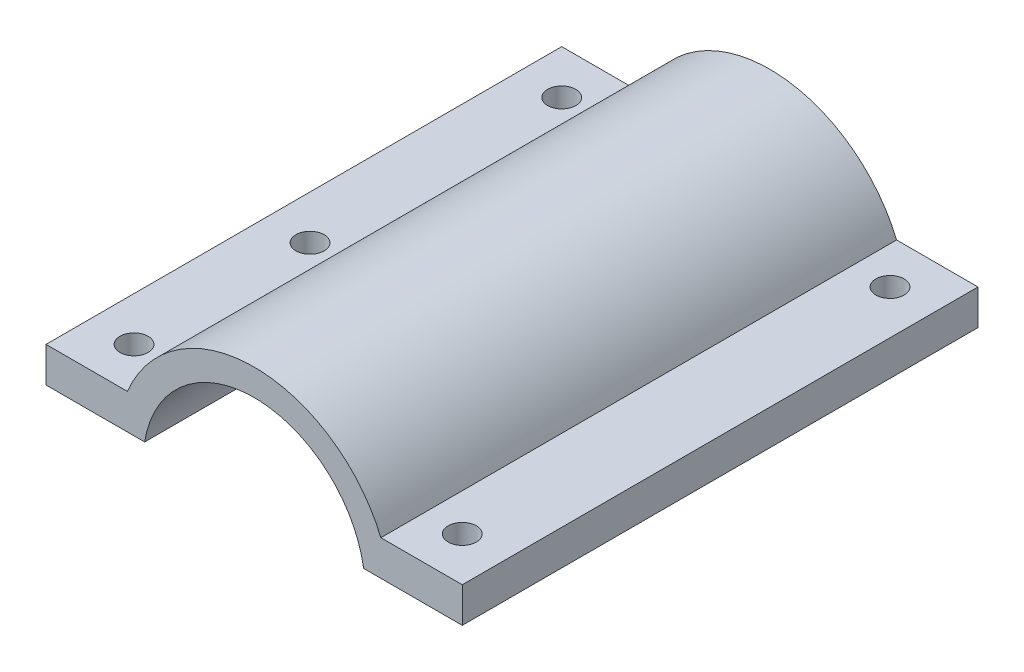
ISO-10303-21;
HEADER;
FILE_DESCRIPTION(('STEP AP214'),'2;1');
FILE_NAME('part.step','',(''),(''),'','','');
FILE_SCHEMA(('AUTOMOTIVE_DESIGN { 1 0 10303 214 1 1 1 1 }'));
ENDSEC;
DATA;
#1=APPLICATION_CONTEXT('core data for automotive mechanical design processes');
#2=APPLICATION_PROTOCOL_DEFINITION('international standard','automotive_design',2000,#1);
#3=PRODUCT_CONTEXT('',#1,'mechanical');
#4=PRODUCT('Part','Part','',(#3));
#5=PRODUCT_RELATED_PRODUCT_CATEGORY('part','',(#4));
#6=PRODUCT_DEFINITION_FORMATION('','',#4);
#7=PRODUCT_DEFINITION_CONTEXT('part definition',#1,'design');
#8=PRODUCT_DEFINITION('design','',#6,#7);
#9=PRODUCT_DEFINITION_SHAPE('','',#8);
#10=(LENGTH_UNIT() NAMED_UNIT(*) SI_UNIT(.MILLI.,.METRE.));
#11=(NAMED_UNIT(*) PLANE_ANGLE_UNIT() SI_UNIT($,.RADIAN.));
#12=(NAMED_UNIT(*) SI_UNIT($,.STERADIAN.) SOLID_ANGLE_UNIT());
#13=UNCERTAINTY_MEASURE_WITH_UNIT(LENGTH_MEASURE(1.E-05),#10,'distance_accuracy_value','');
#14=(GEOMETRIC_REPRESENTATION_CONTEXT(3) GLOBAL_UNCERTAINTY_ASSIGNED_CONTEXT((#13)) GLOBAL_UNIT_ASSIGNED_CONTEXT((#10,
#11,#12)) REPRESENTATION_CONTEXT('',''));
#15=CARTESIAN_POINT('',(0.,0.,0.));
#16=DIRECTION('',(0.,0.,1.));
#17=DIRECTION('',(1.,0.,0.));
#18=AXIS2_PLACEMENT_3D('',#15,#16,#17);
#19=CARTESIAN_POINT('',(-23.65,6.,58.6));
#20=DIRECTION('',(1.,0.,0.));
#21=DIRECTION('',(0.,0.,-1.));
#22=AXIS2_PLACEMENT_3D('',#19,#20,#21);
#23=PLANE('',#22);
#24=DIRECTION('',(0.,-1.,0.));
#25=VECTOR('',#24,1.);
#26=CARTESIAN_POINT('',(-23.65,6.,0.));
#27=LINE('',#26,#25);
#28=CARTESIAN_POINT('',(-23.65,6.,0.));
#29=VERTEX_POINT('',#28);
#30=CARTESIAN_POINT('',(-23.65,2.,0.));
#31=VERTEX_POINT('',#30);
#32=EDGE_CURVE('E129',#29,#31,#27,.T.);
#33=ORIENTED_EDGE('',*,*,#32,.T.);
#34=DIRECTION('',(0.,0.,-1.));
#35=VECTOR('',#34,1.);
#36=CARTESIAN_POINT('',(-23.65,2.,58.6));
#37=LINE('',#36,#35);
#38=CARTESIAN_POINT('',(-23.65,2.,58.6));
#39=VERTEX_POINT('',#38);
#40=EDGE_CURVE('E11',#39,#31,#37,.T.);
#41=ORIENTED_EDGE('',*,*,#40,.F.);
#42=DIRECTION('',(0.,-1.,0.));
#43=VECTOR('',#42,1.);
#44=CARTESIAN_POINT('',(-23.65,6.,58.6));
#45=LINE('',#44,#43);
#46=CARTESIAN_POINT('',(-23.65,6.,58.6));
#47=VERTEX_POINT('',#46);
#48=EDGE_CURVE('E144',#47,#39,#45,.T.);
#49=ORIENTED_EDGE('',*,*,#48,.F.);
#50=DIRECTION('',(0.,0.,-1.));
#51=VECTOR('',#50,1.);
#52=CARTESIAN_POINT('',(-23.65,6.,58.6));
#53=LINE('',#52,#51);
#54=EDGE_CURVE('E125',#47,#29,#53,.T.);
#55=ORIENTED_EDGE('',*,*,#54,.T.);
#56=EDGE_LOOP('',(#33,#41,#49,#55));
#57=FACE_BOUND('',#56,.T.);
#58=ADVANCED_FACE('F33',(#57),#23,.F.);
#59=CARTESIAN_POINT('',(-23.65,2.,58.6));
#60=DIRECTION('',(0.,1.,0.));
#61=DIRECTION('',(0.,0.,1.));
#62=AXIS2_PLACEMENT_3D('',#59,#60,#61);
#63=PLANE('',#62);
#64=CARTESIAN_POINT('',(-18.65,2.,33.6));
#65=DIRECTION('',(0.,1.,0.));
#66=DIRECTION('',(0.,0.,1.));
#67=AXIS2_PLACEMENT_3D('',#64,#65,#66);
#68=CIRCLE('',#67,1.6);
#69=CARTESIAN_POINT('',(-18.65,2.,35.2));
#70=VERTEX_POINT('',#69);
#71=EDGE_CURVE('E182',#70,#70,#68,.T.);
#72=ORIENTED_EDGE('',*,*,#71,.T.);
#73=EDGE_LOOP('',(#72));
#74=FACE_BOUND('',#73,.T.);
#75=CARTESIAN_POINT('',(-18.65,2.,5.));
#76=DIRECTION('',(0.,1.,0.));
#77=DIRECTION('',(0.,0.,1.));
#78=AXIS2_PLACEMENT_3D('',#75,#76,#77);
#79=CIRCLE('',#78,1.6);
#80=CARTESIAN_POINT('',(-18.65,2.,6.6));
#81=VERTEX_POINT('',#80);
#82=EDGE_CURVE('E185',#81,#81,#79,.T.);
#83=ORIENTED_EDGE('',*,*,#82,.T.);
#84=EDGE_LOOP('',(#83));
#85=FACE_BOUND('',#84,.T.);
#86=CARTESIAN_POINT('',(-18.65,2.,53.6));
#87=DIRECTION('',(0.,1.,0.));
#88=DIRECTION('',(0.,0.,1.));
#89=AXIS2_PLACEMENT_3D('',#86,#87,#88);
#90=CIRCLE('',#89,1.6);
#91=CARTESIAN_POINT('',(-18.65,2.,55.2));
#92=VERTEX_POINT('',#91);
#93=EDGE_CURVE('E188',#92,#92,#90,.T.);
#94=ORIENTED_EDGE('',*,*,#93,.T.);
#95=EDGE_LOOP('',(#94));
#96=FACE_BOUND('',#95,.T.);
#97=DIRECTION('',(1.,0.,0.));
#98=VECTOR('',#97,1.);
#99=CARTESIAN_POINT('',(-23.65,2.,0.));
#100=LINE('',#99,#98);
#101=CARTESIAN_POINT('',(-12.4402572320672,2.,0.));
#102=VERTEX_POINT('',#101);
#103=EDGE_CURVE('E132',#31,#102,#100,.T.);
#104=ORIENTED_EDGE('',*,*,#103,.T.);
#105=DIRECTION('',(0.,0.,-1.));
#106=VECTOR('',#105,1.);
#107=CARTESIAN_POINT('',(-12.4402572320672,2.,58.6));
#108=LINE('',#107,#106);
#109=CARTESIAN_POINT('',(-12.4402572320672,2.,58.6));
#110=VERTEX_POINT('',#109);
#111=EDGE_CURVE('E41',#110,#102,#108,.T.);
#112=ORIENTED_EDGE('',*,*,#111,.F.);
#113=DIRECTION('',(1.,0.,0.));
#114=VECTOR('',#113,1.);
#115=CARTESIAN_POINT('',(-23.65,2.,58.6));
#116=LINE('',#115,#114);
#117=EDGE_CURVE('E92',#39,#110,#116,.T.);
#118=ORIENTED_EDGE('',*,*,#117,.F.);
#119=ORIENTED_EDGE('',*,*,#40,.T.);
#120=EDGE_LOOP('',(#104,#112,#118,#119));
#121=FACE_BOUND('',#120,.T.);
#122=ADVANCED_FACE('F230',(#74,#85,#96,#121),#63,.F.);
#123=CARTESIAN_POINT('',(0.,0.,58.6));
#124=DIRECTION('',(0.,0.,-1.));
#125=DIRECTION('',(-1.,0.,0.));
#126=AXIS2_PLACEMENT_3D('',#123,#124,#125);
#127=CYLINDRICAL_SURFACE('',#126,12.6);
#128=CARTESIAN_POINT('',(0.,0.,0.));
#129=DIRECTION('',(0.,0.,-1.));
#130=DIRECTION('',(1.,0.,0.));
#131=AXIS2_PLACEMENT_3D('',#128,#129,#130);
#132=CIRCLE('',#131,12.6);
#133=CARTESIAN_POINT('',(12.4402572320672,2.,0.));
#134=VERTEX_POINT('',#133);
#135=EDGE_CURVE('E135',#102,#134,#132,.T.);
#136=ORIENTED_EDGE('',*,*,#135,.T.);
#137=DIRECTION('',(0.,0.,-1.));
#138=VECTOR('',#137,1.);
#139=CARTESIAN_POINT('',(12.4402572320672,2.,58.6));
#140=LINE('',#139,#138);
#141=CARTESIAN_POINT('',(12.4402572320672,2.,58.6));
#142=VERTEX_POINT('',#141);
#143=EDGE_CURVE('E151',#142,#134,#140,.T.);
#144=ORIENTED_EDGE('',*,*,#143,.F.);
#145=CARTESIAN_POINT('',(0.,0.,58.6));
#146=DIRECTION('',(0.,0.,-1.));
#147=DIRECTION('',(1.,0.,0.));
#148=AXIS2_PLACEMENT_3D('',#145,#146,#147);
#149=CIRCLE('',#148,12.6);
#150=EDGE_CURVE('E159',#110,#142,#149,.T.);
#151=ORIENTED_EDGE('',*,*,#150,.F.);
#152=ORIENTED_EDGE('',*,*,#111,.T.);
#153=EDGE_LOOP('',(#136,#144,#151,#152));
#154=FACE_BOUND('',#153,.T.);
#155=ADVANCED_FACE('F157',(#154),#127,.F.);
#156=CARTESIAN_POINT('',(23.65,2.,58.6));
#157=DIRECTION('',(0.,1.,0.));
#158=DIRECTION('',(0.,0.,1.));
#159=AXIS2_PLACEMENT_3D('',#156,#157,#158);
#160=PLANE('',#159);
#161=CARTESIAN_POINT('',(18.65,2.,53.6));
#162=DIRECTION('',(0.,1.,0.));
#163=DIRECTION('',(0.,0.,1.));
#164=AXIS2_PLACEMENT_3D('',#161,#162,#163);
#165=CIRCLE('',#164,1.6);
#166=CARTESIAN_POINT('',(18.65,2.,55.2));
#167=VERTEX_POINT('',#166);
#168=EDGE_CURVE('E133',#167,#167,#165,.T.);
#169=ORIENTED_EDGE('',*,*,#168,.T.);
#170=EDGE_LOOP('',(#169));
#171=FACE_BOUND('',#170,.T.);
#172=CARTESIAN_POINT('',(18.65,2.,5.));
#173=DIRECTION('',(0.,1.,0.));
#174=DIRECTION('',(0.,0.,1.));
#175=AXIS2_PLACEMENT_3D('',#172,#173,#174);
#176=CIRCLE('',#175,1.6);
#177=CARTESIAN_POINT('',(18.65,2.,6.6));
#178=VERTEX_POINT('',#177);
#179=EDGE_CURVE('E179',#178,#178,#176,.T.);
#180=ORIENTED_EDGE('',*,*,#179,.T.);
#181=EDGE_LOOP('',(#180));
#182=FACE_BOUND('',#181,.T.);
#183=DIRECTION('',(1.,0.,0.));
#184=VECTOR('',#183,1.);
#185=CARTESIAN_POINT('',(23.65,2.,0.));
#186=LINE('',#185,#184);
#187=CARTESIAN_POINT('',(23.65,2.,0.));
#188=VERTEX_POINT('',#187);
#189=EDGE_CURVE('E137',#134,#188,#186,.T.);
#190=ORIENTED_EDGE('',*,*,#189,.T.);
#191=DIRECTION('',(0.,0.,-1.));
#192=VECTOR('',#191,1.);
#193=CARTESIAN_POINT('',(23.65,2.,58.6));
#194=LINE('',#193,#192);
#195=CARTESIAN_POINT('',(23.65,2.,58.6));
#196=VERTEX_POINT('',#195);
#197=EDGE_CURVE('E148',#196,#188,#194,.T.);
#198=ORIENTED_EDGE('',*,*,#197,.F.);
#199=DIRECTION('',(1.,0.,0.));
#200=VECTOR('',#199,1.);
#201=CARTESIAN_POINT('',(23.65,2.,58.6));
#202=LINE('',#201,#200);
#203=EDGE_CURVE('E171',#142,#196,#202,.T.);
#204=ORIENTED_EDGE('',*,*,#203,.F.);
#205=ORIENTED_EDGE('',*,*,#143,.T.);
#206=EDGE_LOOP('',(#190,#198,#204,#205));
#207=FACE_BOUND('',#206,.T.);
#208=ADVANCED_FACE('F167',(#171,#182,#207),#160,.F.);
#209=CARTESIAN_POINT('',(23.65,6.,58.6));
#210=DIRECTION('',(-1.,0.,0.));
#211=DIRECTION('',(0.,0.,1.));
#212=AXIS2_PLACEMENT_3D('',#209,#210,#211);
#213=PLANE('',#212);
#214=DIRECTION('',(0.,1.,0.));
#215=VECTOR('',#214,1.);
#216=CARTESIAN_POINT('',(23.65,6.,0.));
#217=LINE('',#216,#215);
#218=CARTESIAN_POINT('',(23.65,6.,0.));
#219=VERTEX_POINT('',#218);
#220=EDGE_CURVE('E139',#188,#219,#217,.T.);
#221=ORIENTED_EDGE('',*,*,#220,.T.);
#222=DIRECTION('',(0.,0.,-1.));
#223=VECTOR('',#222,1.);
#224=CARTESIAN_POINT('',(23.65,6.,58.6));
#225=LINE('',#224,#223);
#226=CARTESIAN_POINT('',(23.65,6.,58.6));
#227=VERTEX_POINT('',#226);
#228=EDGE_CURVE('E120',#227,#219,#225,.T.);
#229=ORIENTED_EDGE('',*,*,#228,.F.);
#230=DIRECTION('',(0.,1.,0.));
#231=VECTOR('',#230,1.);
#232=CARTESIAN_POINT('',(23.65,6.,58.6));
#233=LINE('',#232,#231);
#234=EDGE_CURVE('E111',#196,#227,#233,.T.);
#235=ORIENTED_EDGE('',*,*,#234,.F.);
#236=ORIENTED_EDGE('',*,*,#197,.T.);
#237=EDGE_LOOP('',(#221,#229,#235,#236));
#238=FACE_BOUND('',#237,.T.);
#239=ADVANCED_FACE('F170',(#238),#213,.F.);
#240=CARTESIAN_POINT('',(14.4,6.,58.6));
#241=DIRECTION('',(0.,-1.,0.));
#242=DIRECTION('',(0.,0.,-1.));
#243=AXIS2_PLACEMENT_3D('',#240,#241,#242);
#244=PLANE('',#243);
#245=CARTESIAN_POINT('',(18.65,6.,53.6));
#246=DIRECTION('',(0.,1.,0.));
#247=DIRECTION('',(0.,0.,1.));
#248=AXIS2_PLACEMENT_3D('',#245,#246,#247);
#249=CIRCLE('',#248,1.6);
#250=CARTESIAN_POINT('',(18.65,6.,55.2));
#251=VERTEX_POINT('',#250);
#252=EDGE_CURVE('E194',#251,#251,#249,.T.);
#253=ORIENTED_EDGE('',*,*,#252,.F.);
#254=EDGE_LOOP('',(#253));
#255=FACE_BOUND('',#254,.T.);
#256=CARTESIAN_POINT('',(18.65,6.,5.));
#257=DIRECTION('',(0.,1.,0.));
#258=DIRECTION('',(0.,0.,1.));
#259=AXIS2_PLACEMENT_3D('',#256,#257,#258);
#260=CIRCLE('',#259,1.6);
#261=CARTESIAN_POINT('',(18.65,6.,6.6));
#262=VERTEX_POINT('',#261);
#263=EDGE_CURVE('E191',#262,#262,#260,.T.);
#264=ORIENTED_EDGE('',*,*,#263,.F.);
#265=EDGE_LOOP('',(#264));
#266=FACE_BOUND('',#265,.T.);
#267=DIRECTION('',(-1.,0.,0.));
#268=VECTOR('',#267,1.);
#269=CARTESIAN_POINT('',(14.4,6.,0.));
#270=LINE('',#269,#268);
#271=CARTESIAN_POINT('',(14.4,6.,0.));
#272=VERTEX_POINT('',#271);
#273=EDGE_CURVE('E119',#219,#272,#270,.T.);
#274=ORIENTED_EDGE('',*,*,#273,.T.);
#275=DIRECTION('',(0.,0.,-1.));
#276=VECTOR('',#275,1.);
#277=CARTESIAN_POINT('',(14.4,6.,58.6));
#278=LINE('',#277,#276);
#279=CARTESIAN_POINT('',(14.4,6.,58.6));
#280=VERTEX_POINT('',#279);
#281=EDGE_CURVE('E116',#280,#272,#278,.T.);
#282=ORIENTED_EDGE('',*,*,#281,.F.);
#283=DIRECTION('',(-1.,0.,0.));
#284=VECTOR('',#283,1.);
#285=CARTESIAN_POINT('',(14.4,6.,58.6));
#286=LINE('',#285,#284);
#287=EDGE_CURVE('E105',#227,#280,#286,.T.);
#288=ORIENTED_EDGE('',*,*,#287,.F.);
#289=ORIENTED_EDGE('',*,*,#228,.T.);
#290=EDGE_LOOP('',(#274,#282,#288,#289));
#291=FACE_BOUND('',#290,.T.);
#292=ADVANCED_FACE('F117',(#255,#266,#291),#244,.F.);
#293=CARTESIAN_POINT('',(0.,0.,58.6));
#294=DIRECTION('',(0.,0.,-1.));
#295=DIRECTION('',(-1.,0.,0.));
#296=AXIS2_PLACEMENT_3D('',#293,#294,#295);
#297=CYLINDRICAL_SURFACE('',#296,15.6);
#298=CARTESIAN_POINT('',(0.,0.,0.));
#299=DIRECTION('',(0.,0.,1.));
#300=DIRECTION('',(1.,0.,0.));
#301=AXIS2_PLACEMENT_3D('',#298,#299,#300);
#302=CIRCLE('',#301,15.6);
#303=CARTESIAN_POINT('',(-14.4,6.,0.));
#304=VERTEX_POINT('',#303);
#305=EDGE_CURVE('E78',#272,#304,#302,.T.);
#306=ORIENTED_EDGE('',*,*,#305,.T.);
#307=DIRECTION('',(0.,0.,-1.));
#308=VECTOR('',#307,1.);
#309=CARTESIAN_POINT('',(-14.4,6.,58.6));
#310=LINE('',#309,#308);
#311=CARTESIAN_POINT('',(-14.4,6.,58.6));
#312=VERTEX_POINT('',#311);
#313=EDGE_CURVE('E121',#312,#304,#310,.T.);
#314=ORIENTED_EDGE('',*,*,#313,.F.);
#315=CARTESIAN_POINT('',(0.,0.,58.6));
#316=DIRECTION('',(0.,0.,1.));
#317=DIRECTION('',(1.,0.,0.));
#318=AXIS2_PLACEMENT_3D('',#315,#316,#317);
#319=CIRCLE('',#318,15.6);
#320=EDGE_CURVE('E109',#280,#312,#319,.T.);
#321=ORIENTED_EDGE('',*,*,#320,.F.);
#322=ORIENTED_EDGE('',*,*,#281,.T.);
#323=EDGE_LOOP('',(#306,#314,#321,#322));
#324=FACE_BOUND('',#323,.T.);
#325=ADVANCED_FACE('F123',(#324),#297,.T.);
#326=CARTESIAN_POINT('',(-23.65,6.,58.6));
#327=DIRECTION('',(0.,-1.,0.));
#328=DIRECTION('',(0.,0.,-1.));
#329=AXIS2_PLACEMENT_3D('',#326,#327,#328);
#330=PLANE('',#329);
#331=CARTESIAN_POINT('',(-18.65,6.,33.6));
#332=DIRECTION('',(0.,1.,0.));
#333=DIRECTION('',(0.,0.,1.));
#334=AXIS2_PLACEMENT_3D('',#331,#332,#333);
#335=CIRCLE('',#334,1.6);
#336=CARTESIAN_POINT('',(-18.65,6.,35.2));
#337=VERTEX_POINT('',#336);
#338=EDGE_CURVE('E195',#337,#337,#335,.T.);
#339=ORIENTED_EDGE('',*,*,#338,.F.);
#340=EDGE_LOOP('',(#339));
#341=FACE_BOUND('',#340,.T.);
#342=CARTESIAN_POINT('',(-18.65,6.,5.));
#343=DIRECTION('',(0.,1.,0.));
#344=DIRECTION('',(0.,0.,1.));
#345=AXIS2_PLACEMENT_3D('',#342,#343,#344);
#346=CIRCLE('',#345,1.6);
#347=CARTESIAN_POINT('',(-18.65,6.,6.6));
#348=VERTEX_POINT('',#347);
#349=EDGE_CURVE('E198',#348,#348,#346,.T.);
#350=ORIENTED_EDGE('',*,*,#349,.F.);
#351=EDGE_LOOP('',(#350));
#352=FACE_BOUND('',#351,.T.);
#353=CARTESIAN_POINT('',(-18.65,6.,53.6));
#354=DIRECTION('',(0.,1.,0.));
#355=DIRECTION('',(0.,0.,1.));
#356=AXIS2_PLACEMENT_3D('',#353,#354,#355);
#357=CIRCLE('',#356,1.6);
#358=CARTESIAN_POINT('',(-18.65,6.,55.2));
#359=VERTEX_POINT('',#358);
#360=EDGE_CURVE('E201',#359,#359,#357,.T.);
#361=ORIENTED_EDGE('',*,*,#360,.F.);
#362=EDGE_LOOP('',(#361));
#363=FACE_BOUND('',#362,.T.);
#364=DIRECTION('',(-1.,0.,0.));
#365=VECTOR('',#364,1.);
#366=CARTESIAN_POINT('',(-23.65,6.,0.));
#367=LINE('',#366,#365);
#368=EDGE_CURVE('E84',#304,#29,#367,.T.);
#369=ORIENTED_EDGE('',*,*,#368,.T.);
#370=ORIENTED_EDGE('',*,*,#54,.F.);
#371=DIRECTION('',(-1.,0.,0.));
#372=VECTOR('',#371,1.);
#373=CARTESIAN_POINT('',(-23.65,6.,58.6));
#374=LINE('',#373,#372);
#375=EDGE_CURVE('E49',#312,#47,#374,.T.);
#376=ORIENTED_EDGE('',*,*,#375,.F.);
#377=ORIENTED_EDGE('',*,*,#313,.T.);
#378=EDGE_LOOP('',(#369,#370,#376,#377));
#379=FACE_BOUND('',#378,.T.);
#380=ADVANCED_FACE('F240',(#341,#352,#363,#379),#330,.F.);
#381=CARTESIAN_POINT('',(0.,0.,58.6));
#382=DIRECTION('',(0.,0.,1.));
#383=DIRECTION('',(1.,0.,0.));
#384=AXIS2_PLACEMENT_3D('',#381,#382,#383);
#385=PLANE('',#384);
#386=ORIENTED_EDGE('',*,*,#48,.T.);
#387=ORIENTED_EDGE('',*,*,#117,.T.);
#388=ORIENTED_EDGE('',*,*,#150,.T.);
#389=ORIENTED_EDGE('',*,*,#203,.T.);
#390=ORIENTED_EDGE('',*,*,#234,.T.);
#391=ORIENTED_EDGE('',*,*,#287,.T.);
#392=ORIENTED_EDGE('',*,*,#320,.T.);
#393=ORIENTED_EDGE('',*,*,#375,.T.);
#394=EDGE_LOOP('',(#386,#387,#388,#389,#390,#391,#392,#393));
#395=FACE_BOUND('',#394,.T.);
#396=ADVANCED_FACE('F107',(#395),#385,.T.);
#397=CARTESIAN_POINT('',(0.,0.,0.));
#398=DIRECTION('',(0.,0.,1.));
#399=DIRECTION('',(1.,0.,0.));
#400=AXIS2_PLACEMENT_3D('',#397,#398,#399);
#401=PLANE('',#400);
#402=ORIENTED_EDGE('',*,*,#32,.F.);
#403=ORIENTED_EDGE('',*,*,#368,.F.);
#404=ORIENTED_EDGE('',*,*,#305,.F.);
#405=ORIENTED_EDGE('',*,*,#273,.F.);
#406=ORIENTED_EDGE('',*,*,#220,.F.);
#407=ORIENTED_EDGE('',*,*,#189,.F.);
#408=ORIENTED_EDGE('',*,*,#135,.F.);
#409=ORIENTED_EDGE('',*,*,#103,.F.);
#410=EDGE_LOOP('',(#402,#403,#404,#405,#406,#407,#408,#409));
#411=FACE_BOUND('',#410,.T.);
#412=ADVANCED_FACE('F163',(#411),#401,.F.);
#413=CARTESIAN_POINT('',(-18.65,-52.6,53.6));
#414=DIRECTION('',(0.,1.,0.));
#415=DIRECTION('',(0.,0.,1.));
#416=AXIS2_PLACEMENT_3D('',#413,#414,#415);
#417=CYLINDRICAL_SURFACE('',#416,1.6);
#418=ORIENTED_EDGE('',*,*,#360,.T.);
#419=EDGE_LOOP('',(#418));
#420=FACE_BOUND('',#419,.T.);
#421=ORIENTED_EDGE('',*,*,#93,.F.);
#422=EDGE_LOOP('',(#421));
#423=FACE_BOUND('',#422,.T.);
#424=ADVANCED_FACE('F254',(#420,#423),#417,.F.);
#425=CARTESIAN_POINT('',(-18.65,-52.6,5.));
#426=DIRECTION('',(0.,1.,0.));
#427=DIRECTION('',(0.,0.,1.));
#428=AXIS2_PLACEMENT_3D('',#425,#426,#427);
#429=CYLINDRICAL_SURFACE('',#428,1.6);
#430=ORIENTED_EDGE('',*,*,#349,.T.);
#431=EDGE_LOOP('',(#430));
#432=FACE_BOUND('',#431,.T.);
#433=ORIENTED_EDGE('',*,*,#82,.F.);
#434=EDGE_LOOP('',(#433));
#435=FACE_BOUND('',#434,.T.);
#436=ADVANCED_FACE('F258',(#432,#435),#429,.F.);
#437=CARTESIAN_POINT('',(-18.65,-52.6,33.6));
#438=DIRECTION('',(0.,1.,0.));
#439=DIRECTION('',(0.,0.,1.));
#440=AXIS2_PLACEMENT_3D('',#437,#438,#439);
#441=CYLINDRICAL_SURFACE('',#440,1.6);
#442=ORIENTED_EDGE('',*,*,#338,.T.);
#443=EDGE_LOOP('',(#442));
#444=FACE_BOUND('',#443,.T.);
#445=ORIENTED_EDGE('',*,*,#71,.F.);
#446=EDGE_LOOP('',(#445));
#447=FACE_BOUND('',#446,.T.);
#448=ADVANCED_FACE('F218',(#444,#447),#441,.F.);
#449=CARTESIAN_POINT('',(18.65,-52.6,5.));
#450=DIRECTION('',(0.,1.,0.));
#451=DIRECTION('',(0.,0.,1.));
#452=AXIS2_PLACEMENT_3D('',#449,#450,#451);
#453=CYLINDRICAL_SURFACE('',#452,1.6);
#454=ORIENTED_EDGE('',*,*,#263,.T.);
#455=EDGE_LOOP('',(#454));
#456=FACE_BOUND('',#455,.T.);
#457=ORIENTED_EDGE('',*,*,#179,.F.);
#458=EDGE_LOOP('',(#457));
#459=FACE_BOUND('',#458,.T.);
#460=ADVANCED_FACE('F215',(#456,#459),#453,.F.);
#461=CARTESIAN_POINT('',(18.65,-52.6,53.6));
#462=DIRECTION('',(0.,1.,0.));
#463=DIRECTION('',(0.,0.,1.));
#464=AXIS2_PLACEMENT_3D('',#461,#462,#463);
#465=CYLINDRICAL_SURFACE('',#464,1.6);
#466=ORIENTED_EDGE('',*,*,#252,.T.);
#467=EDGE_LOOP('',(#466));
#468=FACE_BOUND('',#467,.T.);
#469=ORIENTED_EDGE('',*,*,#168,.F.);
#470=EDGE_LOOP('',(#469));
#471=FACE_BOUND('',#470,.T.);
#472=ADVANCED_FACE('F207',(#468,#471),#465,.F.);
#473=CLOSED_SHELL('',(#58,#122,#155,#208,#239,#292,#325,#380,#396,#412,#424,#436,#448,#460,#472));
#474=MANIFOLD_SOLID_BREP('B2',#473);
#475=ADVANCED_BREP_SHAPE_REPRESENTATION('',(#18,#474),#14);
#476=SHAPE_DEFINITION_REPRESENTATION(#9,#475);
ENDSEC;
END-ISO-10303-21;
